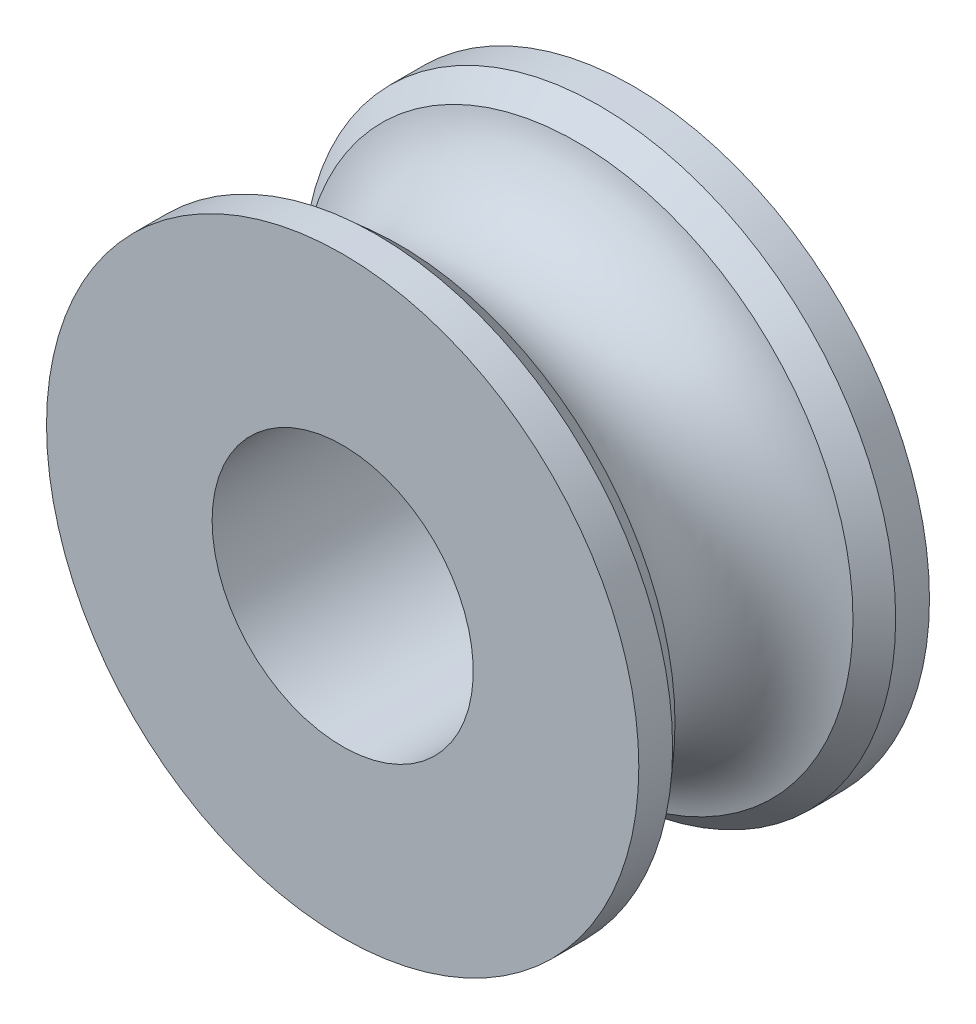
ISO-10303-21;
HEADER;
FILE_DESCRIPTION(('STEP AP214'),'2;1');
FILE_NAME('part.step','',(''),(''),'','','');
FILE_SCHEMA(('AUTOMOTIVE_DESIGN { 1 0 10303 214 1 1 1 1 }'));
ENDSEC;
DATA;
#1=APPLICATION_CONTEXT('core data for automotive mechanical design processes');
#2=APPLICATION_PROTOCOL_DEFINITION('international standard','automotive_design',2000,#1);
#3=PRODUCT_CONTEXT('',#1,'mechanical');
#4=PRODUCT('Part','Part','',(#3));
#5=PRODUCT_RELATED_PRODUCT_CATEGORY('part','',(#4));
#6=PRODUCT_DEFINITION_FORMATION('','',#4);
#7=PRODUCT_DEFINITION_CONTEXT('part definition',#1,'design');
#8=PRODUCT_DEFINITION('design','',#6,#7);
#9=PRODUCT_DEFINITION_SHAPE('','',#8);
#10=(LENGTH_UNIT() NAMED_UNIT(*) SI_UNIT(.MILLI.,.METRE.));
#11=(NAMED_UNIT(*) PLANE_ANGLE_UNIT() SI_UNIT($,.RADIAN.));
#12=(NAMED_UNIT(*) SI_UNIT($,.STERADIAN.) SOLID_ANGLE_UNIT());
#13=UNCERTAINTY_MEASURE_WITH_UNIT(LENGTH_MEASURE(1.E-05),#10,'distance_accuracy_value','');
#14=(GEOMETRIC_REPRESENTATION_CONTEXT(3) GLOBAL_UNCERTAINTY_ASSIGNED_CONTEXT((#13)) GLOBAL_UNIT_ASSIGNED_CONTEXT((#10,
#11,#12)) REPRESENTATION_CONTEXT('',''));
#15=CARTESIAN_POINT('',(0.,0.,0.));
#16=DIRECTION('',(0.,0.,1.));
#17=DIRECTION('',(1.,0.,0.));
#18=AXIS2_PLACEMENT_3D('',#15,#16,#17);
#19=CARTESIAN_POINT('',(0.,0.,14.334));
#20=DIRECTION('',(0.,0.,1.));
#21=DIRECTION('',(1.,0.,0.));
#22=AXIS2_PLACEMENT_3D('',#19,#20,#21);
#23=PLANE('',#22);
#24=CARTESIAN_POINT('',(0.,0.,14.334));
#25=DIRECTION('',(0.,0.,-1.));
#26=DIRECTION('',(1.,0.,0.));
#27=AXIS2_PLACEMENT_3D('',#24,#25,#26);
#28=CIRCLE('',#27,6.4389);
#29=CARTESIAN_POINT('',(-6.4389,0.,14.334));
#30=VERTEX_POINT('',#29);
#31=EDGE_CURVE('E114',#30,#30,#28,.T.);
#32=ORIENTED_EDGE('',*,*,#31,.T.);
#33=EDGE_LOOP('',(#32));
#34=FACE_BOUND('',#33,.T.);
#35=CARTESIAN_POINT('',(0.,0.,14.334));
#36=DIRECTION('',(0.,0.,1.));
#37=DIRECTION('',(1.,0.,0.));
#38=AXIS2_PLACEMENT_3D('',#35,#36,#37);
#39=CIRCLE('',#38,14.605);
#40=CARTESIAN_POINT('',(-14.605,0.,14.334));
#41=VERTEX_POINT('',#40);
#42=EDGE_CURVE('E111',#41,#41,#39,.T.);
#43=ORIENTED_EDGE('',*,*,#42,.T.);
#44=EDGE_LOOP('',(#43));
#45=FACE_BOUND('',#44,.T.);
#46=ADVANCED_FACE('F17',(#34,#45),#23,.T.);
#47=CARTESIAN_POINT('',(0.,0.,7.167));
#48=DIRECTION('',(0.,0.,1.));
#49=DIRECTION('',(1.,0.,0.));
#50=AXIS2_PLACEMENT_3D('',#47,#48,#49);
#51=TOROIDAL_SURFACE('',#50,14.605,4.5);
#52=CARTESIAN_POINT('',(0.,0.,2.77811111111106));
#53=DIRECTION('',(0.,0.,-1.));
#54=DIRECTION('',(-1.,0.,0.));
#55=AXIS2_PLACEMENT_3D('',#52,#53,#54);
#56=CIRCLE('',#55,13.6111920100003);
#57=CARTESIAN_POINT('',(13.6111920100003,0.,2.77811111111106));
#58=VERTEX_POINT('',#57);
#59=CARTESIAN_POINT('',(-13.6111920100003,0.,2.77811111111106));
#60=VERTEX_POINT('',#59);
#61=EDGE_CURVE('E94',#58,#60,#56,.T.);
#62=ORIENTED_EDGE('',*,*,#61,.F.);
#63=CARTESIAN_POINT('',(0.,0.,2.77811111111106));
#64=DIRECTION('',(0.,0.,-1.));
#65=DIRECTION('',(-1.,0.,0.));
#66=AXIS2_PLACEMENT_3D('',#63,#64,#65);
#67=CIRCLE('',#66,13.6111920100003);
#68=EDGE_CURVE('E96',#60,#58,#67,.T.);
#69=ORIENTED_EDGE('',*,*,#68,.F.);
#70=CARTESIAN_POINT('',(-14.605,0.,7.167));
#71=DIRECTION('',(0.,-1.,0.));
#72=DIRECTION('',(-1.,0.,0.));
#73=AXIS2_PLACEMENT_3D('',#70,#71,#72);
#74=CIRCLE('',#73,4.5);
#75=CARTESIAN_POINT('',(-13.6111920100003,0.,11.5558888888889));
#76=VERTEX_POINT('',#75);
#77=EDGE_CURVE('E11',#60,#76,#74,.T.);
#78=ORIENTED_EDGE('',*,*,#77,.T.);
#79=CARTESIAN_POINT('',(0.,0.,11.5558888888889));
#80=DIRECTION('',(0.,0.,1.));
#81=DIRECTION('',(-1.,0.,0.));
#82=AXIS2_PLACEMENT_3D('',#79,#80,#81);
#83=CIRCLE('',#82,13.6111920100003);
#84=CARTESIAN_POINT('',(13.6111920100003,0.,11.5558888888889));
#85=VERTEX_POINT('',#84);
#86=EDGE_CURVE('E146',#85,#76,#83,.T.);
#87=ORIENTED_EDGE('',*,*,#86,.F.);
#88=CARTESIAN_POINT('',(0.,0.,11.5558888888889));
#89=DIRECTION('',(0.,0.,1.));
#90=DIRECTION('',(-1.,0.,0.));
#91=AXIS2_PLACEMENT_3D('',#88,#89,#90);
#92=CIRCLE('',#91,13.6111920100003);
#93=EDGE_CURVE('E57',#76,#85,#92,.T.);
#94=ORIENTED_EDGE('',*,*,#93,.F.);
#95=ORIENTED_EDGE('',*,*,#77,.F.);
#96=EDGE_LOOP('',(#62,#69,#78,#87,#94,#95));
#97=FACE_BOUND('',#96,.T.);
#98=ADVANCED_FACE('F92',(#97),#51,.F.);
#99=CARTESIAN_POINT('',(14.605,0.,0.));
#100=DIRECTION('',(0.,0.,-1.));
#101=DIRECTION('',(0.,-1.,0.));
#102=AXIS2_PLACEMENT_3D('',#99,#100,#101);
#103=PLANE('',#102);
#104=CARTESIAN_POINT('',(0.,0.,0.));
#105=DIRECTION('',(0.,0.,1.));
#106=DIRECTION('',(1.,0.,0.));
#107=AXIS2_PLACEMENT_3D('',#104,#105,#106);
#108=CIRCLE('',#107,6.4389);
#109=CARTESIAN_POINT('',(-6.4389,0.,0.));
#110=VERTEX_POINT('',#109);
#111=EDGE_CURVE('E26',#110,#110,#108,.T.);
#112=ORIENTED_EDGE('',*,*,#111,.T.);
#113=EDGE_LOOP('',(#112));
#114=FACE_BOUND('',#113,.T.);
#115=CARTESIAN_POINT('',(0.,0.,0.));
#116=DIRECTION('',(0.,0.,1.));
#117=DIRECTION('',(1.,0.,0.));
#118=AXIS2_PLACEMENT_3D('',#115,#116,#117);
#119=CIRCLE('',#118,14.605);
#120=CARTESIAN_POINT('',(-14.605,0.,0.));
#121=VERTEX_POINT('',#120);
#122=EDGE_CURVE('E110',#121,#121,#119,.T.);
#123=ORIENTED_EDGE('',*,*,#122,.F.);
#124=EDGE_LOOP('',(#123));
#125=FACE_BOUND('',#124,.T.);
#126=ADVANCED_FACE('F177',(#114,#125),#103,.T.);
#127=CARTESIAN_POINT('',(0.,0.,14.334));
#128=DIRECTION('',(0.,0.,-1.));
#129=DIRECTION('',(1.,0.,0.));
#130=AXIS2_PLACEMENT_3D('',#127,#128,#129);
#131=CYLINDRICAL_SURFACE('',#130,6.4389);
#132=ORIENTED_EDGE('',*,*,#31,.F.);
#133=DIRECTION('',(0.,0.,-1.));
#134=VECTOR('',#133,1.);
#135=CARTESIAN_POINT('',(-6.4389,0.,14.334));
#136=LINE('',#135,#134);
#137=EDGE_CURVE('E117',#30,#110,#136,.T.);
#138=ORIENTED_EDGE('',*,*,#137,.T.);
#139=ORIENTED_EDGE('',*,*,#111,.F.);
#140=ORIENTED_EDGE('',*,*,#137,.F.);
#141=EDGE_LOOP('',(#132,#138,#139,#140));
#142=FACE_BOUND('',#141,.T.);
#143=ADVANCED_FACE('F181',(#142),#131,.F.);
#144=CARTESIAN_POINT('',(0.,0.,13.0005));
#145=DIRECTION('',(0.,0.,1.));
#146=DIRECTION('',(1.,0.,0.));
#147=AXIS2_PLACEMENT_3D('',#144,#145,#146);
#148=CYLINDRICAL_SURFACE('',#147,14.605);
#149=ORIENTED_EDGE('',*,*,#42,.F.);
#150=DIRECTION('',(0.,0.,-1.));
#151=VECTOR('',#150,1.);
#152=CARTESIAN_POINT('',(-14.605,0.,13.0005));
#153=LINE('',#152,#151);
#154=CARTESIAN_POINT('',(-14.605,0.,12.667));
#155=VERTEX_POINT('',#154);
#156=EDGE_CURVE('E67',#41,#155,#153,.T.);
#157=ORIENTED_EDGE('',*,*,#156,.T.);
#158=CARTESIAN_POINT('',(0.,0.,12.667));
#159=DIRECTION('',(0.,0.,-1.));
#160=DIRECTION('',(-1.,0.,0.));
#161=AXIS2_PLACEMENT_3D('',#158,#159,#160);
#162=CIRCLE('',#161,14.605);
#163=CARTESIAN_POINT('',(14.605,0.,12.667));
#164=VERTEX_POINT('',#163);
#165=EDGE_CURVE('E134',#164,#155,#162,.T.);
#166=ORIENTED_EDGE('',*,*,#165,.F.);
#167=CARTESIAN_POINT('',(0.,0.,12.667));
#168=DIRECTION('',(0.,0.,-1.));
#169=DIRECTION('',(-1.,0.,0.));
#170=AXIS2_PLACEMENT_3D('',#167,#168,#169);
#171=CIRCLE('',#170,14.605);
#172=EDGE_CURVE('E129',#155,#164,#171,.T.);
#173=ORIENTED_EDGE('',*,*,#172,.F.);
#174=ORIENTED_EDGE('',*,*,#156,.F.);
#175=EDGE_LOOP('',(#149,#157,#166,#173,#174));
#176=FACE_BOUND('',#175,.T.);
#177=ADVANCED_FACE('F188',(#176),#148,.T.);
#178=CARTESIAN_POINT('',(0.,0.,12.1114444444445));
#179=DIRECTION('',(0.,0.,1.));
#180=DIRECTION('',(-1.,0.,0.));
#181=AXIS2_PLACEMENT_3D('',#178,#179,#180);
#182=CONICAL_SURFACE('',#181,14.1080960050001,0.729727656226888);
#183=ORIENTED_EDGE('',*,*,#165,.T.);
#184=ORIENTED_EDGE('',*,*,#172,.T.);
#185=DIRECTION('',(-0.666666666666608,0.,-0.745355992499982));
#186=VECTOR('',#185,1.);
#187=CARTESIAN_POINT('',(14.1080960050001,0.,12.1114444444445));
#188=LINE('',#187,#186);
#189=EDGE_CURVE('E133',#164,#85,#188,.T.);
#190=ORIENTED_EDGE('',*,*,#189,.T.);
#191=ORIENTED_EDGE('',*,*,#86,.T.);
#192=ORIENTED_EDGE('',*,*,#93,.T.);
#193=ORIENTED_EDGE('',*,*,#189,.F.);
#194=EDGE_LOOP('',(#183,#184,#190,#191,#192,#193));
#195=FACE_BOUND('',#194,.T.);
#196=ADVANCED_FACE('F172',(#195),#182,.T.);
#197=CARTESIAN_POINT('',(0.,0.,1.3335));
#198=DIRECTION('',(0.,0.,1.));
#199=DIRECTION('',(1.,0.,0.));
#200=AXIS2_PLACEMENT_3D('',#197,#198,#199);
#201=CYLINDRICAL_SURFACE('',#200,14.605);
#202=CARTESIAN_POINT('',(0.,0.,1.667));
#203=DIRECTION('',(0.,0.,1.));
#204=DIRECTION('',(-1.,0.,0.));
#205=AXIS2_PLACEMENT_3D('',#202,#203,#204);
#206=CIRCLE('',#205,14.605);
#207=CARTESIAN_POINT('',(14.605,0.,1.667));
#208=VERTEX_POINT('',#207);
#209=CARTESIAN_POINT('',(-14.605,0.,1.667));
#210=VERTEX_POINT('',#209);
#211=EDGE_CURVE('E121',#208,#210,#206,.T.);
#212=ORIENTED_EDGE('',*,*,#211,.F.);
#213=CARTESIAN_POINT('',(0.,0.,1.667));
#214=DIRECTION('',(0.,0.,1.));
#215=DIRECTION('',(-1.,0.,0.));
#216=AXIS2_PLACEMENT_3D('',#213,#214,#215);
#217=CIRCLE('',#216,14.605);
#218=EDGE_CURVE('E122',#210,#208,#217,.T.);
#219=ORIENTED_EDGE('',*,*,#218,.F.);
#220=DIRECTION('',(0.,0.,-1.));
#221=VECTOR('',#220,1.);
#222=CARTESIAN_POINT('',(-14.605,0.,1.3335));
#223=LINE('',#222,#221);
#224=EDGE_CURVE('E125',#210,#121,#223,.T.);
#225=ORIENTED_EDGE('',*,*,#224,.T.);
#226=ORIENTED_EDGE('',*,*,#122,.T.);
#227=ORIENTED_EDGE('',*,*,#224,.F.);
#228=EDGE_LOOP('',(#212,#219,#225,#226,#227));
#229=FACE_BOUND('',#228,.T.);
#230=ADVANCED_FACE('F164',(#229),#201,.T.);
#231=CARTESIAN_POINT('',(0.,0.,2.22255555555553));
#232=DIRECTION('',(0.,0.,-1.));
#233=DIRECTION('',(-1.,0.,0.));
#234=AXIS2_PLACEMENT_3D('',#231,#232,#233);
#235=CONICAL_SURFACE('',#234,14.1080960050001,0.729727656226888);
#236=ORIENTED_EDGE('',*,*,#61,.T.);
#237=ORIENTED_EDGE('',*,*,#68,.T.);
#238=DIRECTION('',(0.666666666666608,0.,-0.745355992499982));
#239=VECTOR('',#238,1.);
#240=CARTESIAN_POINT('',(14.1080960050001,0.,2.22255555555553));
#241=LINE('',#240,#239);
#242=EDGE_CURVE('E100',#58,#208,#241,.T.);
#243=ORIENTED_EDGE('',*,*,#242,.T.);
#244=ORIENTED_EDGE('',*,*,#211,.T.);
#245=ORIENTED_EDGE('',*,*,#218,.T.);
#246=ORIENTED_EDGE('',*,*,#242,.F.);
#247=EDGE_LOOP('',(#236,#237,#243,#244,#245,#246));
#248=FACE_BOUND('',#247,.T.);
#249=ADVANCED_FACE('F102',(#248),#235,.T.);
#250=CLOSED_SHELL('',(#46,#98,#126,#143,#177,#196,#230,#249));
#251=MANIFOLD_SOLID_BREP('B1',#250);
#252=ADVANCED_BREP_SHAPE_REPRESENTATION('',(#18,#251),#14);
#253=SHAPE_DEFINITION_REPRESENTATION(#9,#252);
ENDSEC;
END-ISO-10303-21;
